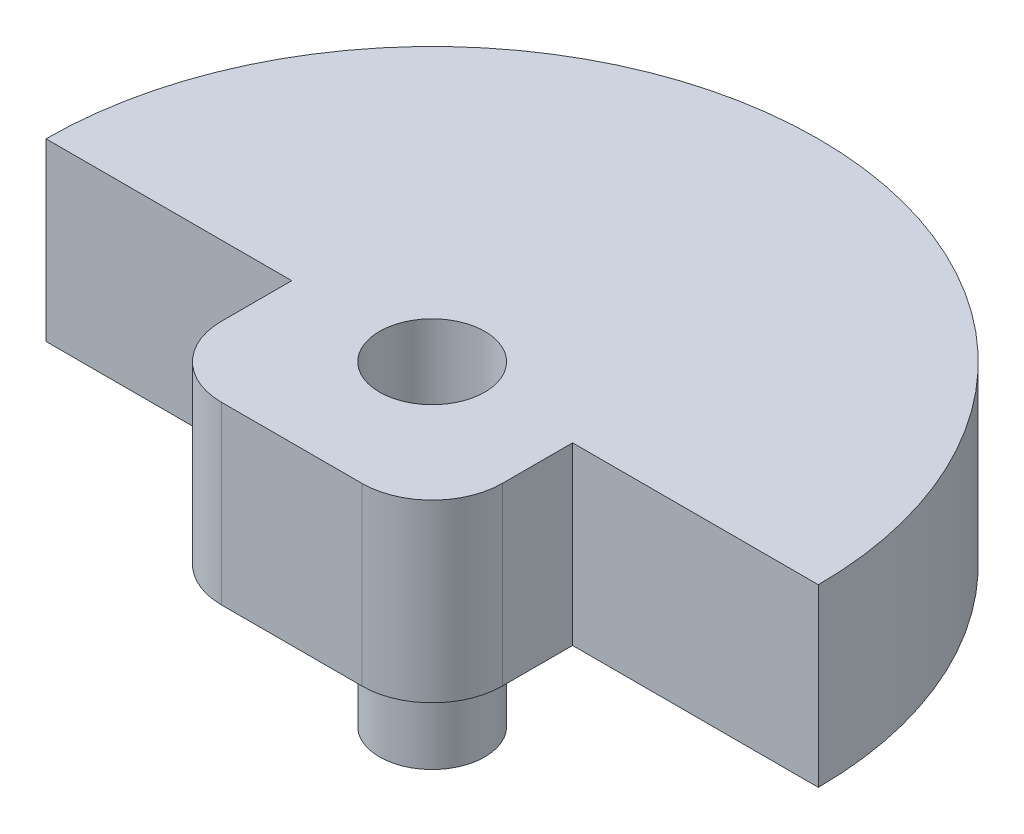
ISO-10303-21;
HEADER;
FILE_DESCRIPTION(('STEP AP214'),'2;1');
FILE_NAME('part.step','',(''),(''),'','','');
FILE_SCHEMA(('AUTOMOTIVE_DESIGN { 1 0 10303 214 1 1 1 1 }'));
ENDSEC;
DATA;
#1=APPLICATION_CONTEXT('core data for automotive mechanical design processes');
#2=APPLICATION_PROTOCOL_DEFINITION('international standard','automotive_design',2000,#1);
#3=PRODUCT_CONTEXT('',#1,'mechanical');
#4=PRODUCT('Part','Part','',(#3));
#5=PRODUCT_RELATED_PRODUCT_CATEGORY('part','',(#4));
#6=PRODUCT_DEFINITION_FORMATION('','',#4);
#7=PRODUCT_DEFINITION_CONTEXT('part definition',#1,'design');
#8=PRODUCT_DEFINITION('design','',#6,#7);
#9=PRODUCT_DEFINITION_SHAPE('','',#8);
#10=(LENGTH_UNIT() NAMED_UNIT(*) SI_UNIT(.MILLI.,.METRE.));
#11=(NAMED_UNIT(*) PLANE_ANGLE_UNIT() SI_UNIT($,.RADIAN.));
#12=(NAMED_UNIT(*) SI_UNIT($,.STERADIAN.) SOLID_ANGLE_UNIT());
#13=UNCERTAINTY_MEASURE_WITH_UNIT(LENGTH_MEASURE(1.E-05),#10,'distance_accuracy_value','');
#14=(GEOMETRIC_REPRESENTATION_CONTEXT(3) GLOBAL_UNCERTAINTY_ASSIGNED_CONTEXT((#13)) GLOBAL_UNIT_ASSIGNED_CONTEXT((#10,
#11,#12)) REPRESENTATION_CONTEXT('',''));
#15=CARTESIAN_POINT('',(0.,0.,0.));
#16=DIRECTION('',(0.,0.,1.));
#17=DIRECTION('',(1.,0.,0.));
#18=AXIS2_PLACEMENT_3D('',#15,#16,#17);
#19=CARTESIAN_POINT('',(1.,2.25,0.));
#20=DIRECTION('',(1.,0.,0.));
#21=DIRECTION('',(0.,0.,-1.));
#22=AXIS2_PLACEMENT_3D('',#19,#20,#21);
#23=PLANE('',#22);
#24=DIRECTION('',(0.,0.,1.));
#25=VECTOR('',#24,1.);
#26=CARTESIAN_POINT('',(1.,2.25,0.));
#27=LINE('',#26,#25);
#28=CARTESIAN_POINT('',(1.,2.25,0.));
#29=VERTEX_POINT('',#28);
#30=CARTESIAN_POINT('',(1.,2.25,0.5));
#31=VERTEX_POINT('',#30);
#32=EDGE_CURVE('E113',#29,#31,#27,.T.);
#33=ORIENTED_EDGE('',*,*,#32,.T.);
#34=DIRECTION('',(0.,-1.,0.));
#35=VECTOR('',#34,1.);
#36=CARTESIAN_POINT('',(1.,1.,0.5));
#37=LINE('',#36,#35);
#38=CARTESIAN_POINT('',(1.,1.,0.5));
#39=VERTEX_POINT('',#38);
#40=EDGE_CURVE('E12',#31,#39,#37,.T.);
#41=ORIENTED_EDGE('',*,*,#40,.T.);
#42=DIRECTION('',(0.,0.,1.));
#43=VECTOR('',#42,1.);
#44=CARTESIAN_POINT('',(1.,1.,0.));
#45=LINE('',#44,#43);
#46=CARTESIAN_POINT('',(1.,1.,0.));
#47=VERTEX_POINT('',#46);
#48=EDGE_CURVE('E116',#47,#39,#45,.T.);
#49=ORIENTED_EDGE('',*,*,#48,.F.);
#50=DIRECTION('',(0.,-1.,0.));
#51=VECTOR('',#50,1.);
#52=CARTESIAN_POINT('',(1.,2.25,0.));
#53=LINE('',#52,#51);
#54=EDGE_CURVE('E111',#29,#47,#53,.T.);
#55=ORIENTED_EDGE('',*,*,#54,.F.);
#56=EDGE_LOOP('',(#33,#41,#49,#55));
#57=FACE_BOUND('',#56,.T.);
#58=ADVANCED_FACE('F43',(#57),#23,.T.);
#59=CARTESIAN_POINT('',(0.,2.25,0.));
#60=DIRECTION('',(0.,0.,-1.));
#61=DIRECTION('',(-1.,0.,0.));
#62=AXIS2_PLACEMENT_3D('',#59,#60,#61);
#63=PLANE('',#62);
#64=DIRECTION('',(1.,0.,0.));
#65=VECTOR('',#64,1.);
#66=CARTESIAN_POINT('',(0.,1.,0.));
#67=LINE('',#66,#65);
#68=CARTESIAN_POINT('',(2.75,1.,0.));
#69=VERTEX_POINT('',#68);
#70=EDGE_CURVE('E148',#47,#69,#67,.T.);
#71=ORIENTED_EDGE('',*,*,#70,.T.);
#72=DIRECTION('',(0.,-1.,0.));
#73=VECTOR('',#72,1.);
#74=CARTESIAN_POINT('',(2.75,2.25,0.));
#75=LINE('',#74,#73);
#76=CARTESIAN_POINT('',(2.75,2.25,0.));
#77=VERTEX_POINT('',#76);
#78=EDGE_CURVE('E120',#77,#69,#75,.T.);
#79=ORIENTED_EDGE('',*,*,#78,.F.);
#80=DIRECTION('',(1.,0.,0.));
#81=VECTOR('',#80,1.);
#82=CARTESIAN_POINT('',(0.,2.25,0.));
#83=LINE('',#82,#81);
#84=EDGE_CURVE('E123',#29,#77,#83,.T.);
#85=ORIENTED_EDGE('',*,*,#84,.F.);
#86=ORIENTED_EDGE('',*,*,#54,.T.);
#87=EDGE_LOOP('',(#71,#79,#85,#86));
#88=FACE_BOUND('',#87,.T.);
#89=ADVANCED_FACE('F124',(#88),#63,.F.);
#90=CARTESIAN_POINT('',(0.,2.25,0.));
#91=DIRECTION('',(0.,-1.,0.));
#92=DIRECTION('',(0.,0.,-1.));
#93=AXIS2_PLACEMENT_3D('',#90,#91,#92);
#94=CYLINDRICAL_SURFACE('',#93,2.75);
#95=CARTESIAN_POINT('',(0.,1.,0.));
#96=DIRECTION('',(0.,1.,0.));
#97=DIRECTION('',(0.,0.,1.));
#98=AXIS2_PLACEMENT_3D('',#95,#96,#97);
#99=CIRCLE('',#98,2.75);
#100=CARTESIAN_POINT('',(-2.75,1.,0.));
#101=VERTEX_POINT('',#100);
#102=EDGE_CURVE('E150',#69,#101,#99,.T.);
#103=ORIENTED_EDGE('',*,*,#102,.T.);
#104=DIRECTION('',(0.,-1.,0.));
#105=VECTOR('',#104,1.);
#106=CARTESIAN_POINT('',(-2.75,2.25,0.));
#107=LINE('',#106,#105);
#108=CARTESIAN_POINT('',(-2.75,2.25,0.));
#109=VERTEX_POINT('',#108);
#110=EDGE_CURVE('E159',#109,#101,#107,.T.);
#111=ORIENTED_EDGE('',*,*,#110,.F.);
#112=CARTESIAN_POINT('',(0.,2.25,0.));
#113=DIRECTION('',(0.,1.,0.));
#114=DIRECTION('',(0.,0.,1.));
#115=AXIS2_PLACEMENT_3D('',#112,#113,#114);
#116=CIRCLE('',#115,2.75);
#117=EDGE_CURVE('E127',#77,#109,#116,.T.);
#118=ORIENTED_EDGE('',*,*,#117,.F.);
#119=ORIENTED_EDGE('',*,*,#78,.T.);
#120=EDGE_LOOP('',(#103,#111,#118,#119));
#121=FACE_BOUND('',#120,.T.);
#122=ADVANCED_FACE('F194',(#121),#94,.T.);
#123=CARTESIAN_POINT('',(-1.,1.,0.));
#124=VERTEX_POINT('',#123);
#125=EDGE_CURVE('E151',#101,#124,#67,.T.);
#126=ORIENTED_EDGE('',*,*,#125,.T.);
#127=DIRECTION('',(0.,-1.,0.));
#128=VECTOR('',#127,1.);
#129=CARTESIAN_POINT('',(-1.,2.25,0.));
#130=LINE('',#129,#128);
#131=CARTESIAN_POINT('',(-1.,2.25,0.));
#132=VERTEX_POINT('',#131);
#133=EDGE_CURVE('E146',#132,#124,#130,.T.);
#134=ORIENTED_EDGE('',*,*,#133,.F.);
#135=EDGE_CURVE('E129',#109,#132,#83,.T.);
#136=ORIENTED_EDGE('',*,*,#135,.F.);
#137=ORIENTED_EDGE('',*,*,#110,.T.);
#138=EDGE_LOOP('',(#126,#134,#136,#137));
#139=FACE_BOUND('',#138,.T.);
#140=ADVANCED_FACE('F190',(#139),#63,.F.);
#141=CARTESIAN_POINT('',(-1.,2.25,0.));
#142=DIRECTION('',(1.,0.,0.));
#143=DIRECTION('',(0.,0.,-1.));
#144=AXIS2_PLACEMENT_3D('',#141,#142,#143);
#145=PLANE('',#144);
#146=DIRECTION('',(0.,0.,1.));
#147=VECTOR('',#146,1.);
#148=CARTESIAN_POINT('',(-1.,1.,0.));
#149=LINE('',#148,#147);
#150=CARTESIAN_POINT('',(-1.,1.,0.5));
#151=VERTEX_POINT('',#150);
#152=EDGE_CURVE('E153',#124,#151,#149,.T.);
#153=ORIENTED_EDGE('',*,*,#152,.T.);
#154=DIRECTION('',(0.,-1.,0.));
#155=VECTOR('',#154,1.);
#156=CARTESIAN_POINT('',(-1.,2.25,0.5));
#157=LINE('',#156,#155);
#158=CARTESIAN_POINT('',(-1.,2.25,0.5));
#159=VERTEX_POINT('',#158);
#160=EDGE_CURVE('E66',#151,#159,#157,.F.);
#161=ORIENTED_EDGE('',*,*,#160,.T.);
#162=DIRECTION('',(0.,0.,1.));
#163=VECTOR('',#162,1.);
#164=CARTESIAN_POINT('',(-1.,2.25,0.));
#165=LINE('',#164,#163);
#166=EDGE_CURVE('E139',#132,#159,#165,.T.);
#167=ORIENTED_EDGE('',*,*,#166,.F.);
#168=ORIENTED_EDGE('',*,*,#133,.T.);
#169=EDGE_LOOP('',(#153,#161,#167,#168));
#170=FACE_BOUND('',#169,.T.);
#171=ADVANCED_FACE('F186',(#170),#145,.F.);
#172=CARTESIAN_POINT('',(0.,2.25,1.));
#173=DIRECTION('',(0.,0.,-1.));
#174=DIRECTION('',(-1.,0.,0.));
#175=AXIS2_PLACEMENT_3D('',#172,#173,#174);
#176=PLANE('',#175);
#177=DIRECTION('',(1.,0.,0.));
#178=VECTOR('',#177,1.);
#179=CARTESIAN_POINT('',(0.,2.25,1.));
#180=LINE('',#179,#178);
#181=CARTESIAN_POINT('',(-0.5,2.25,1.));
#182=VERTEX_POINT('',#181);
#183=CARTESIAN_POINT('',(0.5,2.25,1.));
#184=VERTEX_POINT('',#183);
#185=EDGE_CURVE('E141',#182,#184,#180,.T.);
#186=ORIENTED_EDGE('',*,*,#185,.F.);
#187=DIRECTION('',(0.,-1.,0.));
#188=VECTOR('',#187,1.);
#189=CARTESIAN_POINT('',(-0.5,2.25,1.));
#190=LINE('',#189,#188);
#191=CARTESIAN_POINT('',(-0.5,1.,1.));
#192=VERTEX_POINT('',#191);
#193=EDGE_CURVE('E164',#182,#192,#190,.T.);
#194=ORIENTED_EDGE('',*,*,#193,.T.);
#195=DIRECTION('',(1.,0.,0.));
#196=VECTOR('',#195,1.);
#197=CARTESIAN_POINT('',(0.,1.,1.));
#198=LINE('',#197,#196);
#199=CARTESIAN_POINT('',(0.5,1.,1.));
#200=VERTEX_POINT('',#199);
#201=EDGE_CURVE('E135',#192,#200,#198,.T.);
#202=ORIENTED_EDGE('',*,*,#201,.T.);
#203=DIRECTION('',(0.,-1.,0.));
#204=VECTOR('',#203,1.);
#205=CARTESIAN_POINT('',(0.5,2.25,1.));
#206=LINE('',#205,#204);
#207=EDGE_CURVE('E119',#200,#184,#206,.F.);
#208=ORIENTED_EDGE('',*,*,#207,.T.);
#209=EDGE_LOOP('',(#186,#194,#202,#208));
#210=FACE_BOUND('',#209,.T.);
#211=ADVANCED_FACE('F177',(#210),#176,.F.);
#212=CARTESIAN_POINT('',(0.,2.25,0.));
#213=DIRECTION('',(0.,-1.,0.));
#214=DIRECTION('',(0.,0.,-1.));
#215=AXIS2_PLACEMENT_3D('',#212,#213,#214);
#216=CYLINDRICAL_SURFACE('',#215,0.375);
#217=CARTESIAN_POINT('',(0.,2.25,0.));
#218=DIRECTION('',(0.,1.,0.));
#219=DIRECTION('',(0.,0.,1.));
#220=AXIS2_PLACEMENT_3D('',#217,#218,#219);
#221=CIRCLE('',#220,0.375);
#222=CARTESIAN_POINT('',(0.,2.25,0.375));
#223=VERTEX_POINT('',#222);
#224=EDGE_CURVE('E143',#223,#223,#221,.T.);
#225=ORIENTED_EDGE('',*,*,#224,.T.);
#226=EDGE_LOOP('',(#225));
#227=FACE_BOUND('',#226,.T.);
#228=CARTESIAN_POINT('',(0.,1.,0.));
#229=DIRECTION('',(0.,1.,0.));
#230=DIRECTION('',(0.,0.,1.));
#231=AXIS2_PLACEMENT_3D('',#228,#229,#230);
#232=CIRCLE('',#231,0.375);
#233=CARTESIAN_POINT('',(0.,1.,0.375));
#234=VERTEX_POINT('',#233);
#235=EDGE_CURVE('E132',#234,#234,#232,.T.);
#236=ORIENTED_EDGE('',*,*,#235,.F.);
#237=EDGE_LOOP('',(#236));
#238=FACE_BOUND('',#237,.T.);
#239=ADVANCED_FACE('F216',(#227,#238),#216,.F.);
#240=CARTESIAN_POINT('',(0.,2.25,0.));
#241=DIRECTION('',(0.,1.,0.));
#242=DIRECTION('',(0.,0.,1.));
#243=AXIS2_PLACEMENT_3D('',#240,#241,#242);
#244=PLANE('',#243);
#245=ORIENTED_EDGE('',*,*,#166,.T.);
#246=CARTESIAN_POINT('',(-0.5,2.25,0.5));
#247=DIRECTION('',(0.,1.,0.));
#248=DIRECTION('',(0.,0.,1.));
#249=AXIS2_PLACEMENT_3D('',#246,#247,#248);
#250=CIRCLE('',#249,0.5);
#251=EDGE_CURVE('E51',#159,#182,#250,.T.);
#252=ORIENTED_EDGE('',*,*,#251,.T.);
#253=ORIENTED_EDGE('',*,*,#185,.T.);
#254=CARTESIAN_POINT('',(0.5,2.25,0.5));
#255=DIRECTION('',(0.,1.,0.));
#256=DIRECTION('',(0.,0.,1.));
#257=AXIS2_PLACEMENT_3D('',#254,#255,#256);
#258=CIRCLE('',#257,0.5);
#259=EDGE_CURVE('E58',#184,#31,#258,.T.);
#260=ORIENTED_EDGE('',*,*,#259,.T.);
#261=ORIENTED_EDGE('',*,*,#32,.F.);
#262=ORIENTED_EDGE('',*,*,#84,.T.);
#263=ORIENTED_EDGE('',*,*,#117,.T.);
#264=ORIENTED_EDGE('',*,*,#135,.T.);
#265=EDGE_LOOP('',(#245,#252,#253,#260,#261,#262,#263,#264));
#266=FACE_BOUND('',#265,.T.);
#267=ORIENTED_EDGE('',*,*,#224,.F.);
#268=EDGE_LOOP('',(#267));
#269=FACE_BOUND('',#268,.T.);
#270=ADVANCED_FACE('F130',(#266,#269),#244,.T.);
#271=CARTESIAN_POINT('',(0.,1.,0.));
#272=DIRECTION('',(0.,1.,0.));
#273=DIRECTION('',(0.,0.,1.));
#274=AXIS2_PLACEMENT_3D('',#271,#272,#273);
#275=PLANE('',#274);
#276=ORIENTED_EDGE('',*,*,#201,.F.);
#277=CARTESIAN_POINT('',(-0.5,1.,0.5));
#278=DIRECTION('',(0.,1.,0.));
#279=DIRECTION('',(0.,0.,1.));
#280=AXIS2_PLACEMENT_3D('',#277,#278,#279);
#281=CIRCLE('',#280,0.5);
#282=EDGE_CURVE('E169',#192,#151,#281,.F.);
#283=ORIENTED_EDGE('',*,*,#282,.T.);
#284=ORIENTED_EDGE('',*,*,#152,.F.);
#285=ORIENTED_EDGE('',*,*,#125,.F.);
#286=ORIENTED_EDGE('',*,*,#102,.F.);
#287=ORIENTED_EDGE('',*,*,#70,.F.);
#288=ORIENTED_EDGE('',*,*,#48,.T.);
#289=CARTESIAN_POINT('',(0.5,1.,0.5));
#290=DIRECTION('',(0.,1.,0.));
#291=DIRECTION('',(0.,0.,1.));
#292=AXIS2_PLACEMENT_3D('',#289,#290,#291);
#293=CIRCLE('',#292,0.5);
#294=EDGE_CURVE('E167',#39,#200,#293,.F.);
#295=ORIENTED_EDGE('',*,*,#294,.T.);
#296=EDGE_LOOP('',(#276,#283,#284,#285,#286,#287,#288,#295));
#297=FACE_BOUND('',#296,.T.);
#298=ORIENTED_EDGE('',*,*,#235,.T.);
#299=EDGE_LOOP('',(#298));
#300=FACE_BOUND('',#299,.T.);
#301=ADVANCED_FACE('F183',(#297,#300),#275,.F.);
#302=CARTESIAN_POINT('',(-0.5,2.25,0.5));
#303=DIRECTION('',(0.,-1.,0.));
#304=DIRECTION('',(0.,0.,-1.));
#305=AXIS2_PLACEMENT_3D('',#302,#303,#304);
#306=CYLINDRICAL_SURFACE('',#305,0.5);
#307=ORIENTED_EDGE('',*,*,#251,.F.);
#308=ORIENTED_EDGE('',*,*,#160,.F.);
#309=ORIENTED_EDGE('',*,*,#282,.F.);
#310=ORIENTED_EDGE('',*,*,#193,.F.);
#311=EDGE_LOOP('',(#307,#308,#309,#310));
#312=FACE_BOUND('',#311,.T.);
#313=ADVANCED_FACE('F180',(#312),#306,.T.);
#314=CARTESIAN_POINT('',(0.5,2.25,0.5));
#315=DIRECTION('',(0.,1.,0.));
#316=DIRECTION('',(0.,0.,1.));
#317=AXIS2_PLACEMENT_3D('',#314,#315,#316);
#318=CYLINDRICAL_SURFACE('',#317,0.5);
#319=ORIENTED_EDGE('',*,*,#259,.F.);
#320=ORIENTED_EDGE('',*,*,#207,.F.);
#321=ORIENTED_EDGE('',*,*,#294,.F.);
#322=ORIENTED_EDGE('',*,*,#40,.F.);
#323=EDGE_LOOP('',(#319,#320,#321,#322));
#324=FACE_BOUND('',#323,.T.);
#325=ADVANCED_FACE('F45',(#324),#318,.T.);
#326=CLOSED_SHELL('',(#58,#89,#122,#140,#171,#211,#239,#270,#301,#313,#325));
#327=MANIFOLD_SOLID_BREP('B2',#326);
#328=CARTESIAN_POINT('',(0.,1.,0.));
#329=DIRECTION('',(0.,-1.,0.));
#330=DIRECTION('',(0.,0.,-1.));
#331=AXIS2_PLACEMENT_3D('',#328,#329,#330);
#332=CYLINDRICAL_SURFACE('',#331,0.375);
#333=CARTESIAN_POINT('',(0.,1.,0.));
#334=DIRECTION('',(0.,1.,0.));
#335=DIRECTION('',(0.,0.,1.));
#336=AXIS2_PLACEMENT_3D('',#333,#334,#335);
#337=CIRCLE('',#336,0.375);
#338=CARTESIAN_POINT('',(0.,1.,0.375));
#339=VERTEX_POINT('',#338);
#340=EDGE_CURVE('E42',#339,#339,#337,.T.);
#341=ORIENTED_EDGE('',*,*,#340,.F.);
#342=EDGE_LOOP('',(#341));
#343=FACE_BOUND('',#342,.T.);
#344=CARTESIAN_POINT('',(0.,0.,0.));
#345=DIRECTION('',(0.,1.,0.));
#346=DIRECTION('',(0.,0.,1.));
#347=AXIS2_PLACEMENT_3D('',#344,#345,#346);
#348=CIRCLE('',#347,0.375);
#349=CARTESIAN_POINT('',(0.,0.,0.375));
#350=VERTEX_POINT('',#349);
#351=EDGE_CURVE('E304',#350,#350,#348,.T.);
#352=ORIENTED_EDGE('',*,*,#351,.T.);
#353=EDGE_LOOP('',(#352));
#354=FACE_BOUND('',#353,.T.);
#355=ADVANCED_FACE('F301',(#343,#354),#332,.T.);
#356=CARTESIAN_POINT('',(0.,1.,0.));
#357=DIRECTION('',(0.,1.,0.));
#358=DIRECTION('',(0.,0.,1.));
#359=AXIS2_PLACEMENT_3D('',#356,#357,#358);
#360=PLANE('',#359);
#361=ORIENTED_EDGE('',*,*,#340,.T.);
#362=EDGE_LOOP('',(#361));
#363=FACE_BOUND('',#362,.T.);
#364=ADVANCED_FACE('F316',(#363),#360,.T.);
#365=CARTESIAN_POINT('',(0.,0.,0.));
#366=DIRECTION('',(0.,1.,0.));
#367=DIRECTION('',(0.,0.,1.));
#368=AXIS2_PLACEMENT_3D('',#365,#366,#367);
#369=PLANE('',#368);
#370=ORIENTED_EDGE('',*,*,#351,.F.);
#371=EDGE_LOOP('',(#370));
#372=FACE_BOUND('',#371,.T.);
#373=ADVANCED_FACE('F314',(#372),#369,.F.);
#374=CLOSED_SHELL('',(#355,#364,#373));
#375=MANIFOLD_SOLID_BREP('B6',#374);
#376=ADVANCED_BREP_SHAPE_REPRESENTATION('',(#18,#327,#375),#14);
#377=SHAPE_DEFINITION_REPRESENTATION(#9,#376);
ENDSEC;
END-ISO-10303-21;
